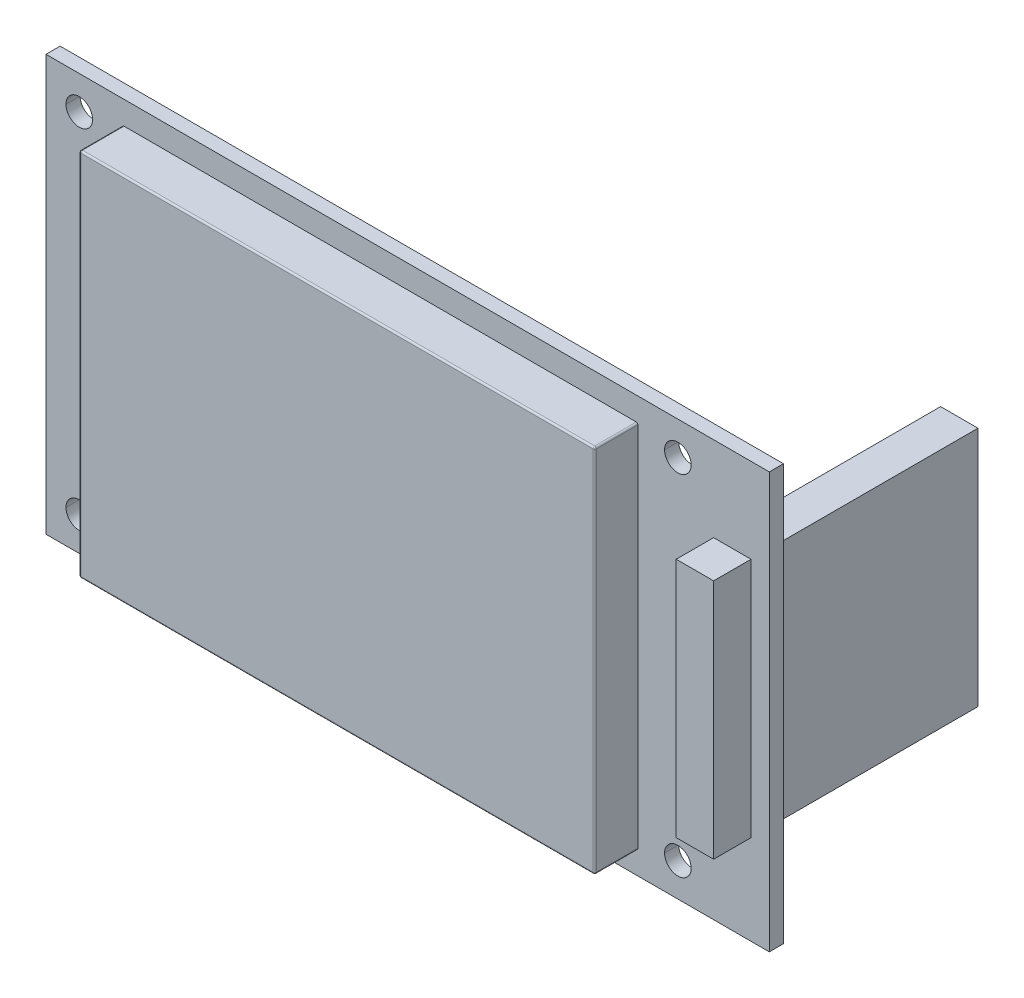
ISO-10303-21;
HEADER;
FILE_DESCRIPTION(('STEP AP214'),'2;1');
FILE_NAME('part.step','',(''),(''),'','','');
FILE_SCHEMA(('AUTOMOTIVE_DESIGN { 1 0 10303 214 1 1 1 1 }'));
ENDSEC;
DATA;
#1=APPLICATION_CONTEXT('core data for automotive mechanical design processes');
#2=APPLICATION_PROTOCOL_DEFINITION('international standard','automotive_design',2000,#1);
#3=PRODUCT_CONTEXT('',#1,'mechanical');
#4=PRODUCT('Part','Part','',(#3));
#5=PRODUCT_RELATED_PRODUCT_CATEGORY('part','',(#4));
#6=PRODUCT_DEFINITION_FORMATION('','',#4);
#7=PRODUCT_DEFINITION_CONTEXT('part definition',#1,'design');
#8=PRODUCT_DEFINITION('design','',#6,#7);
#9=PRODUCT_DEFINITION_SHAPE('','',#8);
#10=(LENGTH_UNIT() NAMED_UNIT(*) SI_UNIT(.MILLI.,.METRE.));
#11=(NAMED_UNIT(*) PLANE_ANGLE_UNIT() SI_UNIT($,.RADIAN.));
#12=(NAMED_UNIT(*) SI_UNIT($,.STERADIAN.) SOLID_ANGLE_UNIT());
#13=UNCERTAINTY_MEASURE_WITH_UNIT(LENGTH_MEASURE(1.E-05),#10,'distance_accuracy_value','');
#14=(GEOMETRIC_REPRESENTATION_CONTEXT(3) GLOBAL_UNCERTAINTY_ASSIGNED_CONTEXT((#13)) GLOBAL_UNIT_ASSIGNED_CONTEXT((#10,
#11,#12)) REPRESENTATION_CONTEXT('',''));
#15=CARTESIAN_POINT('',(0.,0.,0.));
#16=DIRECTION('',(0.,0.,1.));
#17=DIRECTION('',(1.,0.,0.));
#18=AXIS2_PLACEMENT_3D('',#15,#16,#17);
#19=CARTESIAN_POINT('',(-39.5,21.,0.));
#20=DIRECTION('',(0.,0.,-1.));
#21=DIRECTION('',(1.,0.,0.));
#22=AXIS2_PLACEMENT_3D('',#19,#20,#21);
#23=CYLINDRICAL_SURFACE('',#22,1.6);
#24=CARTESIAN_POINT('',(-39.5,21.,1.7));
#25=DIRECTION('',(0.,0.,1.));
#26=DIRECTION('',(1.,0.,0.));
#27=AXIS2_PLACEMENT_3D('',#24,#25,#26);
#28=CIRCLE('',#27,1.6);
#29=CARTESIAN_POINT('',(-41.1,21.,1.7));
#30=VERTEX_POINT('',#29);
#31=CARTESIAN_POINT('',(-37.9,21.,1.7));
#32=VERTEX_POINT('',#31);
#33=EDGE_CURVE('E9',#30,#32,#28,.T.);
#34=ORIENTED_EDGE('',*,*,#33,.T.);
#35=DIRECTION('',(0.,0.,-1.));
#36=VECTOR('',#35,1.);
#37=CARTESIAN_POINT('',(-37.9,21.,0.));
#38=LINE('',#37,#36);
#39=CARTESIAN_POINT('',(-37.9,21.,0.));
#40=VERTEX_POINT('',#39);
#41=EDGE_CURVE('E27',#40,#32,#38,.F.);
#42=ORIENTED_EDGE('',*,*,#41,.F.);
#43=CARTESIAN_POINT('',(-39.5,21.,0.));
#44=DIRECTION('',(0.,0.,-1.));
#45=DIRECTION('',(-1.,0.,0.));
#46=AXIS2_PLACEMENT_3D('',#43,#44,#45);
#47=CIRCLE('',#46,1.6);
#48=CARTESIAN_POINT('',(-41.1,21.,0.));
#49=VERTEX_POINT('',#48);
#50=EDGE_CURVE('E1039',#40,#49,#47,.T.);
#51=ORIENTED_EDGE('',*,*,#50,.T.);
#52=DIRECTION('',(0.,0.,-1.));
#53=VECTOR('',#52,1.);
#54=CARTESIAN_POINT('',(-41.1,21.,0.));
#55=LINE('',#54,#53);
#56=EDGE_CURVE('E503',#49,#30,#55,.F.);
#57=ORIENTED_EDGE('',*,*,#56,.T.);
#58=EDGE_LOOP('',(#34,#42,#51,#57));
#59=FACE_BOUND('',#58,.T.);
#60=ADVANCED_FACE('F16',(#59),#23,.F.);
#61=CARTESIAN_POINT('',(32.5,21.,0.));
#62=DIRECTION('',(0.,0.,-1.));
#63=DIRECTION('',(1.,0.,0.));
#64=AXIS2_PLACEMENT_3D('',#61,#62,#63);
#65=CYLINDRICAL_SURFACE('',#64,1.6);
#66=CARTESIAN_POINT('',(32.5,21.,1.7));
#67=DIRECTION('',(0.,0.,1.));
#68=DIRECTION('',(1.,0.,0.));
#69=AXIS2_PLACEMENT_3D('',#66,#67,#68);
#70=CIRCLE('',#69,1.6);
#71=CARTESIAN_POINT('',(30.9,21.,1.7));
#72=VERTEX_POINT('',#71);
#73=CARTESIAN_POINT('',(34.1,21.,1.7));
#74=VERTEX_POINT('',#73);
#75=EDGE_CURVE('E1046',#72,#74,#70,.T.);
#76=ORIENTED_EDGE('',*,*,#75,.T.);
#77=DIRECTION('',(0.,0.,-1.));
#78=VECTOR('',#77,1.);
#79=CARTESIAN_POINT('',(34.1,21.,0.));
#80=LINE('',#79,#78);
#81=CARTESIAN_POINT('',(34.1,21.,0.));
#82=VERTEX_POINT('',#81);
#83=EDGE_CURVE('E1053',#82,#74,#80,.F.);
#84=ORIENTED_EDGE('',*,*,#83,.F.);
#85=CARTESIAN_POINT('',(32.5,21.,0.));
#86=DIRECTION('',(0.,0.,-1.));
#87=DIRECTION('',(-1.,0.,0.));
#88=AXIS2_PLACEMENT_3D('',#85,#86,#87);
#89=CIRCLE('',#88,1.6);
#90=CARTESIAN_POINT('',(30.9,21.,0.));
#91=VERTEX_POINT('',#90);
#92=EDGE_CURVE('E1059',#82,#91,#89,.T.);
#93=ORIENTED_EDGE('',*,*,#92,.T.);
#94=DIRECTION('',(0.,0.,-1.));
#95=VECTOR('',#94,1.);
#96=CARTESIAN_POINT('',(30.9,21.,0.));
#97=LINE('',#96,#95);
#98=EDGE_CURVE('E481',#91,#72,#97,.F.);
#99=ORIENTED_EDGE('',*,*,#98,.T.);
#100=EDGE_LOOP('',(#76,#84,#93,#99));
#101=FACE_BOUND('',#100,.T.);
#102=ADVANCED_FACE('F559',(#101),#65,.F.);
#103=CARTESIAN_POINT('',(32.5,-21.,0.));
#104=DIRECTION('',(0.,0.,-1.));
#105=DIRECTION('',(1.,0.,0.));
#106=AXIS2_PLACEMENT_3D('',#103,#104,#105);
#107=CYLINDRICAL_SURFACE('',#106,1.6);
#108=CARTESIAN_POINT('',(32.5,-21.,1.7));
#109=DIRECTION('',(0.,0.,1.));
#110=DIRECTION('',(1.,0.,0.));
#111=AXIS2_PLACEMENT_3D('',#108,#109,#110);
#112=CIRCLE('',#111,1.6);
#113=CARTESIAN_POINT('',(30.9,-21.,1.7));
#114=VERTEX_POINT('',#113);
#115=CARTESIAN_POINT('',(34.1,-21.,1.7));
#116=VERTEX_POINT('',#115);
#117=EDGE_CURVE('E1066',#114,#116,#112,.T.);
#118=ORIENTED_EDGE('',*,*,#117,.T.);
#119=DIRECTION('',(0.,0.,-1.));
#120=VECTOR('',#119,1.);
#121=CARTESIAN_POINT('',(34.1,-21.,0.));
#122=LINE('',#121,#120);
#123=CARTESIAN_POINT('',(34.1,-21.,0.));
#124=VERTEX_POINT('',#123);
#125=EDGE_CURVE('E1073',#124,#116,#122,.F.);
#126=ORIENTED_EDGE('',*,*,#125,.F.);
#127=CARTESIAN_POINT('',(32.5,-21.,0.));
#128=DIRECTION('',(0.,0.,-1.));
#129=DIRECTION('',(-1.,0.,0.));
#130=AXIS2_PLACEMENT_3D('',#127,#128,#129);
#131=CIRCLE('',#130,1.6);
#132=CARTESIAN_POINT('',(30.9,-21.,0.));
#133=VERTEX_POINT('',#132);
#134=EDGE_CURVE('E1079',#124,#133,#131,.T.);
#135=ORIENTED_EDGE('',*,*,#134,.T.);
#136=DIRECTION('',(0.,0.,-1.));
#137=VECTOR('',#136,1.);
#138=CARTESIAN_POINT('',(30.9,-21.,0.));
#139=LINE('',#138,#137);
#140=EDGE_CURVE('E458',#133,#114,#139,.F.);
#141=ORIENTED_EDGE('',*,*,#140,.T.);
#142=EDGE_LOOP('',(#118,#126,#135,#141));
#143=FACE_BOUND('',#142,.T.);
#144=ADVANCED_FACE('F572',(#143),#107,.F.);
#145=CARTESIAN_POINT('',(-39.5,-21.,0.));
#146=DIRECTION('',(0.,0.,-1.));
#147=DIRECTION('',(1.,0.,0.));
#148=AXIS2_PLACEMENT_3D('',#145,#146,#147);
#149=CYLINDRICAL_SURFACE('',#148,1.6);
#150=CARTESIAN_POINT('',(-39.5,-21.,1.7));
#151=DIRECTION('',(0.,0.,1.));
#152=DIRECTION('',(1.,0.,0.));
#153=AXIS2_PLACEMENT_3D('',#150,#151,#152);
#154=CIRCLE('',#153,1.6);
#155=CARTESIAN_POINT('',(-41.1,-21.,1.7));
#156=VERTEX_POINT('',#155);
#157=CARTESIAN_POINT('',(-37.9,-21.,1.7));
#158=VERTEX_POINT('',#157);
#159=EDGE_CURVE('E1086',#156,#158,#154,.T.);
#160=ORIENTED_EDGE('',*,*,#159,.T.);
#161=DIRECTION('',(0.,0.,-1.));
#162=VECTOR('',#161,1.);
#163=CARTESIAN_POINT('',(-37.9,-21.,0.));
#164=LINE('',#163,#162);
#165=CARTESIAN_POINT('',(-37.9,-21.,0.));
#166=VERTEX_POINT('',#165);
#167=EDGE_CURVE('E1093',#166,#158,#164,.F.);
#168=ORIENTED_EDGE('',*,*,#167,.F.);
#169=CARTESIAN_POINT('',(-39.5,-21.,0.));
#170=DIRECTION('',(0.,0.,-1.));
#171=DIRECTION('',(-1.,0.,0.));
#172=AXIS2_PLACEMENT_3D('',#169,#170,#171);
#173=CIRCLE('',#172,1.6);
#174=CARTESIAN_POINT('',(-41.1,-21.,0.));
#175=VERTEX_POINT('',#174);
#176=EDGE_CURVE('E1099',#166,#175,#173,.T.);
#177=ORIENTED_EDGE('',*,*,#176,.T.);
#178=DIRECTION('',(0.,0.,-1.));
#179=VECTOR('',#178,1.);
#180=CARTESIAN_POINT('',(-41.1,-21.,0.));
#181=LINE('',#180,#179);
#182=EDGE_CURVE('E245',#175,#156,#181,.F.);
#183=ORIENTED_EDGE('',*,*,#182,.T.);
#184=EDGE_LOOP('',(#160,#168,#177,#183));
#185=FACE_BOUND('',#184,.T.);
#186=ADVANCED_FACE('F584',(#185),#149,.F.);
#187=CARTESIAN_POINT('',(0.,0.,1.7));
#188=DIRECTION('',(0.,0.,1.));
#189=DIRECTION('',(-1.,0.,0.));
#190=AXIS2_PLACEMENT_3D('',#187,#188,#189);
#191=PLANE('',#190);
#192=ORIENTED_EDGE('',*,*,#33,.F.);
#193=CARTESIAN_POINT('',(-39.5,21.,1.7));
#194=DIRECTION('',(0.,0.,1.));
#195=DIRECTION('',(1.,0.,0.));
#196=AXIS2_PLACEMENT_3D('',#193,#194,#195);
#197=CIRCLE('',#196,1.6);
#198=EDGE_CURVE('E497',#32,#30,#197,.T.);
#199=ORIENTED_EDGE('',*,*,#198,.F.);
#200=EDGE_LOOP('',(#192,#199));
#201=FACE_BOUND('',#200,.T.);
#202=ORIENTED_EDGE('',*,*,#75,.F.);
#203=CARTESIAN_POINT('',(32.5,21.,1.7));
#204=DIRECTION('',(0.,0.,1.));
#205=DIRECTION('',(1.,0.,0.));
#206=AXIS2_PLACEMENT_3D('',#203,#204,#205);
#207=CIRCLE('',#206,1.6);
#208=EDGE_CURVE('E474',#74,#72,#207,.T.);
#209=ORIENTED_EDGE('',*,*,#208,.F.);
#210=EDGE_LOOP('',(#202,#209));
#211=FACE_BOUND('',#210,.T.);
#212=ORIENTED_EDGE('',*,*,#117,.F.);
#213=CARTESIAN_POINT('',(32.5,-21.,1.7));
#214=DIRECTION('',(0.,0.,1.));
#215=DIRECTION('',(1.,0.,0.));
#216=AXIS2_PLACEMENT_3D('',#213,#214,#215);
#217=CIRCLE('',#216,1.6);
#218=EDGE_CURVE('E451',#116,#114,#217,.T.);
#219=ORIENTED_EDGE('',*,*,#218,.F.);
#220=EDGE_LOOP('',(#212,#219));
#221=FACE_BOUND('',#220,.T.);
#222=ORIENTED_EDGE('',*,*,#159,.F.);
#223=CARTESIAN_POINT('',(-39.5,-21.,1.7));
#224=DIRECTION('',(0.,0.,1.));
#225=DIRECTION('',(1.,0.,0.));
#226=AXIS2_PLACEMENT_3D('',#223,#224,#225);
#227=CIRCLE('',#226,1.6);
#228=EDGE_CURVE('E238',#158,#156,#227,.T.);
#229=ORIENTED_EDGE('',*,*,#228,.F.);
#230=EDGE_LOOP('',(#222,#229));
#231=FACE_BOUND('',#230,.T.);
#232=DIRECTION('',(-1.,0.,0.));
#233=VECTOR('',#232,1.);
#234=CARTESIAN_POINT('',(-34.3,22.2,1.7));
#235=LINE('',#234,#233);
#236=CARTESIAN_POINT('',(27.5,22.2,1.7));
#237=VERTEX_POINT('',#236);
#238=CARTESIAN_POINT('',(-34.1,22.2,1.7));
#239=VERTEX_POINT('',#238);
#240=EDGE_CURVE('E1212',#237,#239,#235,.T.);
#241=ORIENTED_EDGE('',*,*,#240,.F.);
#242=CARTESIAN_POINT('',(27.5,22.,1.7));
#243=DIRECTION('',(0.,0.,-1.));
#244=DIRECTION('',(1.,0.,0.));
#245=AXIS2_PLACEMENT_3D('',#242,#243,#244);
#246=CIRCLE('',#245,0.2);
#247=CARTESIAN_POINT('',(27.7,22.,1.7));
#248=VERTEX_POINT('',#247);
#249=EDGE_CURVE('E1106',#237,#248,#246,.T.);
#250=ORIENTED_EDGE('',*,*,#249,.T.);
#251=DIRECTION('',(0.,1.,0.));
#252=VECTOR('',#251,1.);
#253=CARTESIAN_POINT('',(27.7,22.2,1.7));
#254=LINE('',#253,#252);
#255=CARTESIAN_POINT('',(27.7,-22.1,1.7));
#256=VERTEX_POINT('',#255);
#257=EDGE_CURVE('E345',#256,#248,#254,.T.);
#258=ORIENTED_EDGE('',*,*,#257,.F.);
#259=CARTESIAN_POINT('',(27.5,-22.1,1.7));
#260=DIRECTION('',(0.,0.,-1.));
#261=DIRECTION('',(1.,0.,0.));
#262=AXIS2_PLACEMENT_3D('',#259,#260,#261);
#263=CIRCLE('',#262,0.2);
#264=CARTESIAN_POINT('',(27.5,-22.3,1.7));
#265=VERTEX_POINT('',#264);
#266=EDGE_CURVE('E1113',#256,#265,#263,.T.);
#267=ORIENTED_EDGE('',*,*,#266,.T.);
#268=DIRECTION('',(1.,0.,0.));
#269=VECTOR('',#268,1.);
#270=CARTESIAN_POINT('',(27.7,-22.3,1.7));
#271=LINE('',#270,#269);
#272=CARTESIAN_POINT('',(-34.1,-22.3,1.7));
#273=VERTEX_POINT('',#272);
#274=EDGE_CURVE('E340',#273,#265,#271,.T.);
#275=ORIENTED_EDGE('',*,*,#274,.F.);
#276=CARTESIAN_POINT('',(-34.1,-22.1,1.7));
#277=DIRECTION('',(0.,0.,-1.));
#278=DIRECTION('',(1.,0.,0.));
#279=AXIS2_PLACEMENT_3D('',#276,#277,#278);
#280=CIRCLE('',#279,0.2);
#281=CARTESIAN_POINT('',(-34.3,-22.1,1.7));
#282=VERTEX_POINT('',#281);
#283=EDGE_CURVE('E1120',#273,#282,#280,.T.);
#284=ORIENTED_EDGE('',*,*,#283,.T.);
#285=DIRECTION('',(0.,-1.,0.));
#286=VECTOR('',#285,1.);
#287=CARTESIAN_POINT('',(-34.3,-22.3,1.7));
#288=LINE('',#287,#286);
#289=CARTESIAN_POINT('',(-34.3,22.,1.7));
#290=VERTEX_POINT('',#289);
#291=EDGE_CURVE('E313',#290,#282,#288,.T.);
#292=ORIENTED_EDGE('',*,*,#291,.F.);
#293=CARTESIAN_POINT('',(-34.1,22.,1.7));
#294=DIRECTION('',(0.,0.,-1.));
#295=DIRECTION('',(1.,0.,0.));
#296=AXIS2_PLACEMENT_3D('',#293,#294,#295);
#297=CIRCLE('',#296,0.2);
#298=EDGE_CURVE('E310',#290,#239,#297,.T.);
#299=ORIENTED_EDGE('',*,*,#298,.T.);
#300=EDGE_LOOP('',(#241,#250,#258,#267,#275,#284,#292,#299));
#301=FACE_BOUND('',#300,.T.);
#302=DIRECTION('',(-1.,0.,0.));
#303=VECTOR('',#302,1.);
#304=CARTESIAN_POINT('',(43.5,25.,1.7));
#305=LINE('',#304,#303);
#306=CARTESIAN_POINT('',(43.5,25.,1.7));
#307=VERTEX_POINT('',#306);
#308=CARTESIAN_POINT('',(-43.5,25.,1.7));
#309=VERTEX_POINT('',#308);
#310=EDGE_CURVE('E1132',#307,#309,#305,.T.);
#311=ORIENTED_EDGE('',*,*,#310,.T.);
#312=DIRECTION('',(0.,-1.,0.));
#313=VECTOR('',#312,1.);
#314=CARTESIAN_POINT('',(-43.5,25.,1.7));
#315=LINE('',#314,#313);
#316=CARTESIAN_POINT('',(-43.5,-25.,1.7));
#317=VERTEX_POINT('',#316);
#318=EDGE_CURVE('E1139',#309,#317,#315,.T.);
#319=ORIENTED_EDGE('',*,*,#318,.T.);
#320=DIRECTION('',(1.,0.,0.));
#321=VECTOR('',#320,1.);
#322=CARTESIAN_POINT('',(-43.5,-25.,1.7));
#323=LINE('',#322,#321);
#324=CARTESIAN_POINT('',(43.5,-25.,1.7));
#325=VERTEX_POINT('',#324);
#326=EDGE_CURVE('E1146',#317,#325,#323,.T.);
#327=ORIENTED_EDGE('',*,*,#326,.T.);
#328=DIRECTION('',(0.,1.,0.));
#329=VECTOR('',#328,1.);
#330=CARTESIAN_POINT('',(43.5,-25.,1.7));
#331=LINE('',#330,#329);
#332=EDGE_CURVE('E1153',#325,#307,#331,.T.);
#333=ORIENTED_EDGE('',*,*,#332,.T.);
#334=EDGE_LOOP('',(#311,#319,#327,#333));
#335=FACE_BOUND('',#334,.T.);
#336=DIRECTION('',(1.,0.,0.));
#337=VECTOR('',#336,1.);
#338=CARTESIAN_POINT('',(41.3,-14.2,1.7));
#339=LINE('',#338,#337);
#340=CARTESIAN_POINT('',(36.8,-14.2,1.7));
#341=VERTEX_POINT('',#340);
#342=CARTESIAN_POINT('',(41.3,-14.2,1.7));
#343=VERTEX_POINT('',#342);
#344=EDGE_CURVE('E409',#341,#343,#339,.T.);
#345=ORIENTED_EDGE('',*,*,#344,.F.);
#346=DIRECTION('',(0.,-1.,0.));
#347=VECTOR('',#346,1.);
#348=CARTESIAN_POINT('',(36.8,-14.2,1.7));
#349=LINE('',#348,#347);
#350=CARTESIAN_POINT('',(36.8,14.8,1.7));
#351=VERTEX_POINT('',#350);
#352=EDGE_CURVE('E404',#351,#341,#349,.T.);
#353=ORIENTED_EDGE('',*,*,#352,.F.);
#354=DIRECTION('',(-1.,0.,0.));
#355=VECTOR('',#354,1.);
#356=CARTESIAN_POINT('',(36.8,14.8,1.7));
#357=LINE('',#356,#355);
#358=CARTESIAN_POINT('',(41.3,14.8,1.7));
#359=VERTEX_POINT('',#358);
#360=EDGE_CURVE('E230',#359,#351,#357,.T.);
#361=ORIENTED_EDGE('',*,*,#360,.F.);
#362=DIRECTION('',(0.,1.,0.));
#363=VECTOR('',#362,1.);
#364=CARTESIAN_POINT('',(41.3,14.8,1.7));
#365=LINE('',#364,#363);
#366=EDGE_CURVE('E227',#343,#359,#365,.T.);
#367=ORIENTED_EDGE('',*,*,#366,.F.);
#368=EDGE_LOOP('',(#345,#353,#361,#367));
#369=FACE_BOUND('',#368,.T.);
#370=ADVANCED_FACE('F596',(#201,#211,#221,#231,#301,#335,#369),#191,.T.);
#371=CARTESIAN_POINT('',(0.,0.,0.));
#372=DIRECTION('',(0.,0.,1.));
#373=DIRECTION('',(-1.,0.,0.));
#374=AXIS2_PLACEMENT_3D('',#371,#372,#373);
#375=PLANE('',#374);
#376=CARTESIAN_POINT('',(-39.5,21.,0.));
#377=DIRECTION('',(0.,0.,-1.));
#378=DIRECTION('',(-1.,0.,0.));
#379=AXIS2_PLACEMENT_3D('',#376,#377,#378);
#380=CIRCLE('',#379,1.6);
#381=EDGE_CURVE('E251',#49,#40,#380,.T.);
#382=ORIENTED_EDGE('',*,*,#381,.F.);
#383=ORIENTED_EDGE('',*,*,#50,.F.);
#384=EDGE_LOOP('',(#382,#383));
#385=FACE_BOUND('',#384,.T.);
#386=CARTESIAN_POINT('',(32.5,21.,0.));
#387=DIRECTION('',(0.,0.,-1.));
#388=DIRECTION('',(-1.,0.,0.));
#389=AXIS2_PLACEMENT_3D('',#386,#387,#388);
#390=CIRCLE('',#389,1.6);
#391=EDGE_CURVE('E488',#91,#82,#390,.T.);
#392=ORIENTED_EDGE('',*,*,#391,.F.);
#393=ORIENTED_EDGE('',*,*,#92,.F.);
#394=EDGE_LOOP('',(#392,#393));
#395=FACE_BOUND('',#394,.T.);
#396=CARTESIAN_POINT('',(32.5,-21.,0.));
#397=DIRECTION('',(0.,0.,-1.));
#398=DIRECTION('',(-1.,0.,0.));
#399=AXIS2_PLACEMENT_3D('',#396,#397,#398);
#400=CIRCLE('',#399,1.6);
#401=EDGE_CURVE('E465',#133,#124,#400,.T.);
#402=ORIENTED_EDGE('',*,*,#401,.F.);
#403=ORIENTED_EDGE('',*,*,#134,.F.);
#404=EDGE_LOOP('',(#402,#403));
#405=FACE_BOUND('',#404,.T.);
#406=CARTESIAN_POINT('',(-39.5,-21.,0.));
#407=DIRECTION('',(0.,0.,-1.));
#408=DIRECTION('',(-1.,0.,0.));
#409=AXIS2_PLACEMENT_3D('',#406,#407,#408);
#410=CIRCLE('',#409,1.6);
#411=EDGE_CURVE('E440',#175,#166,#410,.T.);
#412=ORIENTED_EDGE('',*,*,#411,.F.);
#413=ORIENTED_EDGE('',*,*,#176,.F.);
#414=EDGE_LOOP('',(#412,#413));
#415=FACE_BOUND('',#414,.T.);
#416=DIRECTION('',(-1.,0.,0.));
#417=VECTOR('',#416,1.);
#418=CARTESIAN_POINT('',(43.5,25.,0.));
#419=LINE('',#418,#417);
#420=CARTESIAN_POINT('',(43.5,25.,0.));
#421=VERTEX_POINT('',#420);
#422=CARTESIAN_POINT('',(-43.5,25.,0.));
#423=VERTEX_POINT('',#422);
#424=EDGE_CURVE('E1159',#421,#423,#419,.T.);
#425=ORIENTED_EDGE('',*,*,#424,.F.);
#426=DIRECTION('',(0.,1.,0.));
#427=VECTOR('',#426,1.);
#428=CARTESIAN_POINT('',(43.5,-25.,0.));
#429=LINE('',#428,#427);
#430=CARTESIAN_POINT('',(43.5,-25.,0.));
#431=VERTEX_POINT('',#430);
#432=EDGE_CURVE('E1173',#431,#421,#429,.T.);
#433=ORIENTED_EDGE('',*,*,#432,.F.);
#434=DIRECTION('',(1.,0.,0.));
#435=VECTOR('',#434,1.);
#436=CARTESIAN_POINT('',(-43.5,-25.,0.));
#437=LINE('',#436,#435);
#438=CARTESIAN_POINT('',(-43.5,-25.,0.));
#439=VERTEX_POINT('',#438);
#440=EDGE_CURVE('E1186',#439,#431,#437,.T.);
#441=ORIENTED_EDGE('',*,*,#440,.F.);
#442=DIRECTION('',(0.,-1.,0.));
#443=VECTOR('',#442,1.);
#444=CARTESIAN_POINT('',(-43.5,25.,0.));
#445=LINE('',#444,#443);
#446=EDGE_CURVE('E1199',#423,#439,#445,.T.);
#447=ORIENTED_EDGE('',*,*,#446,.F.);
#448=EDGE_LOOP('',(#425,#433,#441,#447));
#449=FACE_BOUND('',#448,.T.);
#450=DIRECTION('',(0.,1.,0.));
#451=VECTOR('',#450,1.);
#452=CARTESIAN_POINT('',(36.8,14.8,0.));
#453=LINE('',#452,#451);
#454=CARTESIAN_POINT('',(36.8,-14.2,0.));
#455=VERTEX_POINT('',#454);
#456=CARTESIAN_POINT('',(36.8,14.8,0.));
#457=VERTEX_POINT('',#456);
#458=EDGE_CURVE('E371',#455,#457,#453,.T.);
#459=ORIENTED_EDGE('',*,*,#458,.F.);
#460=DIRECTION('',(-1.,0.,0.));
#461=VECTOR('',#460,1.);
#462=CARTESIAN_POINT('',(36.8,-14.2,0.));
#463=LINE('',#462,#461);
#464=CARTESIAN_POINT('',(41.3,-14.2,0.));
#465=VERTEX_POINT('',#464);
#466=EDGE_CURVE('E391',#465,#455,#463,.T.);
#467=ORIENTED_EDGE('',*,*,#466,.F.);
#468=DIRECTION('',(0.,-1.,0.));
#469=VECTOR('',#468,1.);
#470=CARTESIAN_POINT('',(41.3,-14.2,0.));
#471=LINE('',#470,#469);
#472=CARTESIAN_POINT('',(41.3,14.8,0.));
#473=VERTEX_POINT('',#472);
#474=EDGE_CURVE('E377',#473,#465,#471,.T.);
#475=ORIENTED_EDGE('',*,*,#474,.F.);
#476=DIRECTION('',(1.,0.,0.));
#477=VECTOR('',#476,1.);
#478=CARTESIAN_POINT('',(41.3,14.8,0.));
#479=LINE('',#478,#477);
#480=EDGE_CURVE('E376',#457,#473,#479,.T.);
#481=ORIENTED_EDGE('',*,*,#480,.F.);
#482=EDGE_LOOP('',(#459,#467,#475,#481));
#483=FACE_BOUND('',#482,.T.);
#484=ADVANCED_FACE('F608',(#385,#395,#405,#415,#449,#483),#375,.F.);
#485=CARTESIAN_POINT('',(43.5,25.,0.));
#486=DIRECTION('',(0.,1.,0.));
#487=DIRECTION('',(0.,0.,-1.));
#488=AXIS2_PLACEMENT_3D('',#485,#486,#487);
#489=PLANE('',#488);
#490=ORIENTED_EDGE('',*,*,#310,.F.);
#491=DIRECTION('',(0.,0.,1.));
#492=VECTOR('',#491,1.);
#493=CARTESIAN_POINT('',(43.5,25.,0.));
#494=LINE('',#493,#492);
#495=EDGE_CURVE('E1179',#421,#307,#494,.T.);
#496=ORIENTED_EDGE('',*,*,#495,.F.);
#497=ORIENTED_EDGE('',*,*,#424,.T.);
#498=DIRECTION('',(0.,0.,1.));
#499=VECTOR('',#498,1.);
#500=CARTESIAN_POINT('',(-43.5,25.,0.));
#501=LINE('',#500,#499);
#502=EDGE_CURVE('E1166',#423,#309,#501,.T.);
#503=ORIENTED_EDGE('',*,*,#502,.T.);
#504=EDGE_LOOP('',(#490,#496,#497,#503));
#505=FACE_BOUND('',#504,.T.);
#506=ADVANCED_FACE('F620',(#505),#489,.T.);
#507=CARTESIAN_POINT('',(43.5,-25.,0.));
#508=DIRECTION('',(1.,0.,0.));
#509=DIRECTION('',(0.,0.,1.));
#510=AXIS2_PLACEMENT_3D('',#507,#508,#509);
#511=PLANE('',#510);
#512=ORIENTED_EDGE('',*,*,#332,.F.);
#513=DIRECTION('',(0.,0.,1.));
#514=VECTOR('',#513,1.);
#515=CARTESIAN_POINT('',(43.5,-25.,0.));
#516=LINE('',#515,#514);
#517=EDGE_CURVE('E1192',#431,#325,#516,.T.);
#518=ORIENTED_EDGE('',*,*,#517,.F.);
#519=ORIENTED_EDGE('',*,*,#432,.T.);
#520=ORIENTED_EDGE('',*,*,#495,.T.);
#521=EDGE_LOOP('',(#512,#518,#519,#520));
#522=FACE_BOUND('',#521,.T.);
#523=ADVANCED_FACE('F632',(#522),#511,.T.);
#524=CARTESIAN_POINT('',(-43.5,-25.,0.));
#525=DIRECTION('',(0.,-1.,0.));
#526=DIRECTION('',(0.,0.,1.));
#527=AXIS2_PLACEMENT_3D('',#524,#525,#526);
#528=PLANE('',#527);
#529=ORIENTED_EDGE('',*,*,#326,.F.);
#530=DIRECTION('',(0.,0.,1.));
#531=VECTOR('',#530,1.);
#532=CARTESIAN_POINT('',(-43.5,-25.,0.));
#533=LINE('',#532,#531);
#534=EDGE_CURVE('E1205',#439,#317,#533,.T.);
#535=ORIENTED_EDGE('',*,*,#534,.F.);
#536=ORIENTED_EDGE('',*,*,#440,.T.);
#537=ORIENTED_EDGE('',*,*,#517,.T.);
#538=EDGE_LOOP('',(#529,#535,#536,#537));
#539=FACE_BOUND('',#538,.T.);
#540=ADVANCED_FACE('F644',(#539),#528,.T.);
#541=CARTESIAN_POINT('',(-43.5,25.,0.));
#542=DIRECTION('',(-1.,0.,0.));
#543=DIRECTION('',(0.,0.,-1.));
#544=AXIS2_PLACEMENT_3D('',#541,#542,#543);
#545=PLANE('',#544);
#546=ORIENTED_EDGE('',*,*,#318,.F.);
#547=ORIENTED_EDGE('',*,*,#502,.F.);
#548=ORIENTED_EDGE('',*,*,#446,.T.);
#549=ORIENTED_EDGE('',*,*,#534,.T.);
#550=EDGE_LOOP('',(#546,#547,#548,#549));
#551=FACE_BOUND('',#550,.T.);
#552=ADVANCED_FACE('F656',(#551),#545,.T.);
#553=CARTESIAN_POINT('',(-34.3,22.2,6.9));
#554=DIRECTION('',(0.,-1.,0.));
#555=DIRECTION('',(0.,0.,1.));
#556=AXIS2_PLACEMENT_3D('',#553,#554,#555);
#557=PLANE('',#556);
#558=ORIENTED_EDGE('',*,*,#240,.T.);
#559=DIRECTION('',(0.,0.,1.));
#560=VECTOR('',#559,1.);
#561=CARTESIAN_POINT('',(-34.1,22.2,6.9));
#562=LINE('',#561,#560);
#563=CARTESIAN_POINT('',(-34.1,22.2,6.7));
#564=VERTEX_POINT('',#563);
#565=EDGE_CURVE('E1218',#239,#564,#562,.T.);
#566=ORIENTED_EDGE('',*,*,#565,.T.);
#567=DIRECTION('',(1.,0.,0.));
#568=VECTOR('',#567,1.);
#569=CARTESIAN_POINT('',(-34.3,22.2,6.7));
#570=LINE('',#569,#568);
#571=CARTESIAN_POINT('',(27.5,22.2,6.7));
#572=VERTEX_POINT('',#571);
#573=EDGE_CURVE('E326',#564,#572,#570,.T.);
#574=ORIENTED_EDGE('',*,*,#573,.T.);
#575=DIRECTION('',(0.,0.,-1.));
#576=VECTOR('',#575,1.);
#577=CARTESIAN_POINT('',(27.5,22.2,6.9));
#578=LINE('',#577,#576);
#579=EDGE_CURVE('E320',#572,#237,#578,.T.);
#580=ORIENTED_EDGE('',*,*,#579,.T.);
#581=EDGE_LOOP('',(#558,#566,#574,#580));
#582=FACE_BOUND('',#581,.T.);
#583=ADVANCED_FACE('F668',(#582),#557,.F.);
#584=CARTESIAN_POINT('',(-34.3,-22.3,6.9));
#585=DIRECTION('',(1.,0.,0.));
#586=DIRECTION('',(0.,-1.,0.));
#587=AXIS2_PLACEMENT_3D('',#584,#585,#586);
#588=PLANE('',#587);
#589=DIRECTION('',(0.,1.,0.));
#590=VECTOR('',#589,1.);
#591=CARTESIAN_POINT('',(-34.3,-22.3,6.7));
#592=LINE('',#591,#590);
#593=CARTESIAN_POINT('',(-34.3,-22.1,6.7));
#594=VERTEX_POINT('',#593);
#595=CARTESIAN_POINT('',(-34.3,22.,6.7));
#596=VERTEX_POINT('',#595);
#597=EDGE_CURVE('E299',#594,#596,#592,.T.);
#598=ORIENTED_EDGE('',*,*,#597,.T.);
#599=DIRECTION('',(0.,0.,-1.));
#600=VECTOR('',#599,1.);
#601=CARTESIAN_POINT('',(-34.3,22.,6.9));
#602=LINE('',#601,#600);
#603=EDGE_CURVE('E307',#596,#290,#602,.T.);
#604=ORIENTED_EDGE('',*,*,#603,.T.);
#605=ORIENTED_EDGE('',*,*,#291,.T.);
#606=DIRECTION('',(0.,0.,1.));
#607=VECTOR('',#606,1.);
#608=CARTESIAN_POINT('',(-34.3,-22.1,6.9));
#609=LINE('',#608,#607);
#610=EDGE_CURVE('E318',#282,#594,#609,.T.);
#611=ORIENTED_EDGE('',*,*,#610,.T.);
#612=EDGE_LOOP('',(#598,#604,#605,#611));
#613=FACE_BOUND('',#612,.T.);
#614=ADVANCED_FACE('F316',(#613),#588,.F.);
#615=CARTESIAN_POINT('',(27.7,-22.3,6.9));
#616=DIRECTION('',(0.,1.,0.));
#617=DIRECTION('',(1.,0.,0.));
#618=AXIS2_PLACEMENT_3D('',#615,#616,#617);
#619=PLANE('',#618);
#620=DIRECTION('',(-1.,0.,0.));
#621=VECTOR('',#620,1.);
#622=CARTESIAN_POINT('',(27.7,-22.3,6.7));
#623=LINE('',#622,#621);
#624=CARTESIAN_POINT('',(27.5,-22.3,6.7));
#625=VERTEX_POINT('',#624);
#626=CARTESIAN_POINT('',(-34.1,-22.3,6.7));
#627=VERTEX_POINT('',#626);
#628=EDGE_CURVE('E332',#625,#627,#623,.T.);
#629=ORIENTED_EDGE('',*,*,#628,.T.);
#630=DIRECTION('',(0.,0.,-1.));
#631=VECTOR('',#630,1.);
#632=CARTESIAN_POINT('',(-34.1,-22.3,6.9));
#633=LINE('',#632,#631);
#634=EDGE_CURVE('E336',#627,#273,#633,.T.);
#635=ORIENTED_EDGE('',*,*,#634,.T.);
#636=ORIENTED_EDGE('',*,*,#274,.T.);
#637=DIRECTION('',(0.,0.,1.));
#638=VECTOR('',#637,1.);
#639=CARTESIAN_POINT('',(27.5,-22.3,6.9));
#640=LINE('',#639,#638);
#641=EDGE_CURVE('E341',#265,#625,#640,.T.);
#642=ORIENTED_EDGE('',*,*,#641,.T.);
#643=EDGE_LOOP('',(#629,#635,#636,#642));
#644=FACE_BOUND('',#643,.T.);
#645=ADVANCED_FACE('F691',(#644),#619,.F.);
#646=CARTESIAN_POINT('',(27.7,22.2,6.9));
#647=DIRECTION('',(-1.,0.,0.));
#648=DIRECTION('',(0.,1.,0.));
#649=AXIS2_PLACEMENT_3D('',#646,#647,#648);
#650=PLANE('',#649);
#651=ORIENTED_EDGE('',*,*,#257,.T.);
#652=DIRECTION('',(0.,0.,1.));
#653=VECTOR('',#652,1.);
#654=CARTESIAN_POINT('',(27.7,22.,6.9));
#655=LINE('',#654,#653);
#656=CARTESIAN_POINT('',(27.7,22.,6.7));
#657=VERTEX_POINT('',#656);
#658=EDGE_CURVE('E346',#248,#657,#655,.T.);
#659=ORIENTED_EDGE('',*,*,#658,.T.);
#660=DIRECTION('',(0.,-1.,0.));
#661=VECTOR('',#660,1.);
#662=CARTESIAN_POINT('',(27.7,22.2,6.7));
#663=LINE('',#662,#661);
#664=CARTESIAN_POINT('',(27.7,-22.1,6.7));
#665=VERTEX_POINT('',#664);
#666=EDGE_CURVE('E350',#657,#665,#663,.T.);
#667=ORIENTED_EDGE('',*,*,#666,.T.);
#668=DIRECTION('',(0.,0.,-1.));
#669=VECTOR('',#668,1.);
#670=CARTESIAN_POINT('',(27.7,-22.1,6.9));
#671=LINE('',#670,#669);
#672=EDGE_CURVE('E354',#665,#256,#671,.T.);
#673=ORIENTED_EDGE('',*,*,#672,.T.);
#674=EDGE_LOOP('',(#651,#659,#667,#673));
#675=FACE_BOUND('',#674,.T.);
#676=ADVANCED_FACE('F702',(#675),#650,.F.);
#677=CARTESIAN_POINT('',(0.,0.,6.9));
#678=DIRECTION('',(0.,0.,-1.));
#679=DIRECTION('',(1.,0.,0.));
#680=AXIS2_PLACEMENT_3D('',#677,#678,#679);
#681=PLANE('',#680);
#682=DIRECTION('',(0.,1.,0.));
#683=VECTOR('',#682,1.);
#684=CARTESIAN_POINT('',(27.5,0.,6.9));
#685=LINE('',#684,#683);
#686=CARTESIAN_POINT('',(27.5,-22.1,6.9));
#687=VERTEX_POINT('',#686);
#688=CARTESIAN_POINT('',(27.5,22.,6.9));
#689=VERTEX_POINT('',#688);
#690=EDGE_CURVE('E358',#687,#689,#685,.T.);
#691=ORIENTED_EDGE('',*,*,#690,.T.);
#692=DIRECTION('',(-1.,0.,0.));
#693=VECTOR('',#692,1.);
#694=CARTESIAN_POINT('',(0.,22.,6.9));
#695=LINE('',#694,#693);
#696=CARTESIAN_POINT('',(-34.1,22.,6.9));
#697=VERTEX_POINT('',#696);
#698=EDGE_CURVE('E362',#689,#697,#695,.T.);
#699=ORIENTED_EDGE('',*,*,#698,.T.);
#700=DIRECTION('',(0.,-1.,0.));
#701=VECTOR('',#700,1.);
#702=CARTESIAN_POINT('',(-34.1,0.,6.9));
#703=LINE('',#702,#701);
#704=CARTESIAN_POINT('',(-34.1,-22.1,6.9));
#705=VERTEX_POINT('',#704);
#706=EDGE_CURVE('E302',#697,#705,#703,.T.);
#707=ORIENTED_EDGE('',*,*,#706,.T.);
#708=DIRECTION('',(1.,0.,0.));
#709=VECTOR('',#708,1.);
#710=CARTESIAN_POINT('',(0.,-22.1,6.9));
#711=LINE('',#710,#709);
#712=EDGE_CURVE('E367',#705,#687,#711,.T.);
#713=ORIENTED_EDGE('',*,*,#712,.T.);
#714=EDGE_LOOP('',(#691,#699,#707,#713));
#715=FACE_BOUND('',#714,.T.);
#716=ADVANCED_FACE('F714',(#715),#681,.F.);
#717=CARTESIAN_POINT('',(36.8,14.8,-25.6));
#718=DIRECTION('',(1.,0.,0.));
#719=DIRECTION('',(0.,0.,1.));
#720=AXIS2_PLACEMENT_3D('',#717,#718,#719);
#721=PLANE('',#720);
#722=ORIENTED_EDGE('',*,*,#458,.T.);
#723=DIRECTION('',(0.,0.,1.));
#724=VECTOR('',#723,1.);
#725=CARTESIAN_POINT('',(36.8,14.8,-25.6));
#726=LINE('',#725,#724);
#727=CARTESIAN_POINT('',(36.8,14.8,-25.6));
#728=VERTEX_POINT('',#727);
#729=EDGE_CURVE('E372',#728,#457,#726,.T.);
#730=ORIENTED_EDGE('',*,*,#729,.F.);
#731=DIRECTION('',(0.,1.,0.));
#732=VECTOR('',#731,1.);
#733=CARTESIAN_POINT('',(36.8,14.8,-25.6));
#734=LINE('',#733,#732);
#735=CARTESIAN_POINT('',(36.8,-14.2,-25.6));
#736=VERTEX_POINT('',#735);
#737=EDGE_CURVE('E378',#736,#728,#734,.T.);
#738=ORIENTED_EDGE('',*,*,#737,.F.);
#739=DIRECTION('',(0.,0.,1.));
#740=VECTOR('',#739,1.);
#741=CARTESIAN_POINT('',(36.8,-14.2,-25.6));
#742=LINE('',#741,#740);
#743=EDGE_CURVE('E383',#736,#455,#742,.T.);
#744=ORIENTED_EDGE('',*,*,#743,.T.);
#745=EDGE_LOOP('',(#722,#730,#738,#744));
#746=FACE_BOUND('',#745,.T.);
#747=ADVANCED_FACE('F726',(#746),#721,.F.);
#748=CARTESIAN_POINT('',(41.3,14.8,-25.6));
#749=DIRECTION('',(0.,-1.,0.));
#750=DIRECTION('',(0.,0.,1.));
#751=AXIS2_PLACEMENT_3D('',#748,#749,#750);
#752=PLANE('',#751);
#753=ORIENTED_EDGE('',*,*,#480,.T.);
#754=DIRECTION('',(0.,0.,1.));
#755=VECTOR('',#754,1.);
#756=CARTESIAN_POINT('',(41.3,14.8,-25.6));
#757=LINE('',#756,#755);
#758=CARTESIAN_POINT('',(41.3,14.8,-25.6));
#759=VERTEX_POINT('',#758);
#760=EDGE_CURVE('E387',#759,#473,#757,.T.);
#761=ORIENTED_EDGE('',*,*,#760,.F.);
#762=DIRECTION('',(1.,0.,0.));
#763=VECTOR('',#762,1.);
#764=CARTESIAN_POINT('',(41.3,14.8,-25.6));
#765=LINE('',#764,#763);
#766=EDGE_CURVE('E382',#728,#759,#765,.T.);
#767=ORIENTED_EDGE('',*,*,#766,.F.);
#768=ORIENTED_EDGE('',*,*,#729,.T.);
#769=EDGE_LOOP('',(#753,#761,#767,#768));
#770=FACE_BOUND('',#769,.T.);
#771=ADVANCED_FACE('F738',(#770),#752,.F.);
#772=CARTESIAN_POINT('',(41.3,-14.2,-25.6));
#773=DIRECTION('',(-1.,0.,0.));
#774=DIRECTION('',(0.,0.,-1.));
#775=AXIS2_PLACEMENT_3D('',#772,#773,#774);
#776=PLANE('',#775);
#777=ORIENTED_EDGE('',*,*,#474,.T.);
#778=DIRECTION('',(0.,0.,1.));
#779=VECTOR('',#778,1.);
#780=CARTESIAN_POINT('',(41.3,-14.2,-25.6));
#781=LINE('',#780,#779);
#782=CARTESIAN_POINT('',(41.3,-14.2,-25.6));
#783=VERTEX_POINT('',#782);
#784=EDGE_CURVE('E381',#783,#465,#781,.T.);
#785=ORIENTED_EDGE('',*,*,#784,.F.);
#786=DIRECTION('',(0.,-1.,0.));
#787=VECTOR('',#786,1.);
#788=CARTESIAN_POINT('',(41.3,-14.2,-25.6));
#789=LINE('',#788,#787);
#790=EDGE_CURVE('E394',#759,#783,#789,.T.);
#791=ORIENTED_EDGE('',*,*,#790,.F.);
#792=ORIENTED_EDGE('',*,*,#760,.T.);
#793=EDGE_LOOP('',(#777,#785,#791,#792));
#794=FACE_BOUND('',#793,.T.);
#795=ADVANCED_FACE('F750',(#794),#776,.F.);
#796=CARTESIAN_POINT('',(36.8,-14.2,-25.6));
#797=DIRECTION('',(0.,1.,0.));
#798=DIRECTION('',(0.,0.,-1.));
#799=AXIS2_PLACEMENT_3D('',#796,#797,#798);
#800=PLANE('',#799);
#801=ORIENTED_EDGE('',*,*,#466,.T.);
#802=ORIENTED_EDGE('',*,*,#743,.F.);
#803=DIRECTION('',(-1.,0.,0.));
#804=VECTOR('',#803,1.);
#805=CARTESIAN_POINT('',(36.8,-14.2,-25.6));
#806=LINE('',#805,#804);
#807=EDGE_CURVE('E400',#783,#736,#806,.T.);
#808=ORIENTED_EDGE('',*,*,#807,.F.);
#809=ORIENTED_EDGE('',*,*,#784,.T.);
#810=EDGE_LOOP('',(#801,#802,#808,#809));
#811=FACE_BOUND('',#810,.T.);
#812=ADVANCED_FACE('F762',(#811),#800,.F.);
#813=CARTESIAN_POINT('',(0.,0.,-25.6));
#814=DIRECTION('',(0.,0.,1.));
#815=DIRECTION('',(-1.,0.,0.));
#816=AXIS2_PLACEMENT_3D('',#813,#814,#815);
#817=PLANE('',#816);
#818=ORIENTED_EDGE('',*,*,#737,.T.);
#819=ORIENTED_EDGE('',*,*,#766,.T.);
#820=ORIENTED_EDGE('',*,*,#790,.T.);
#821=ORIENTED_EDGE('',*,*,#807,.T.);
#822=EDGE_LOOP('',(#818,#819,#820,#821));
#823=FACE_BOUND('',#822,.T.);
#824=ADVANCED_FACE('F774',(#823),#817,.F.);
#825=CARTESIAN_POINT('',(36.8,-14.2,6.2));
#826=DIRECTION('',(1.,0.,0.));
#827=DIRECTION('',(0.,0.,1.));
#828=AXIS2_PLACEMENT_3D('',#825,#826,#827);
#829=PLANE('',#828);
#830=ORIENTED_EDGE('',*,*,#352,.T.);
#831=DIRECTION('',(0.,0.,-1.));
#832=VECTOR('',#831,1.);
#833=CARTESIAN_POINT('',(36.8,-14.2,6.2));
#834=LINE('',#833,#832);
#835=CARTESIAN_POINT('',(36.8,-14.2,6.2));
#836=VERTEX_POINT('',#835);
#837=EDGE_CURVE('E405',#836,#341,#834,.T.);
#838=ORIENTED_EDGE('',*,*,#837,.F.);
#839=DIRECTION('',(0.,-1.,0.));
#840=VECTOR('',#839,1.);
#841=CARTESIAN_POINT('',(36.8,-14.2,6.2));
#842=LINE('',#841,#840);
#843=CARTESIAN_POINT('',(36.8,14.8,6.2));
#844=VERTEX_POINT('',#843);
#845=EDGE_CURVE('E231',#844,#836,#842,.T.);
#846=ORIENTED_EDGE('',*,*,#845,.F.);
#847=DIRECTION('',(0.,0.,-1.));
#848=VECTOR('',#847,1.);
#849=CARTESIAN_POINT('',(36.8,14.8,6.2));
#850=LINE('',#849,#848);
#851=EDGE_CURVE('E236',#844,#351,#850,.T.);
#852=ORIENTED_EDGE('',*,*,#851,.T.);
#853=EDGE_LOOP('',(#830,#838,#846,#852));
#854=FACE_BOUND('',#853,.T.);
#855=ADVANCED_FACE('F786',(#854),#829,.F.);
#856=CARTESIAN_POINT('',(41.3,-14.2,6.2));
#857=DIRECTION('',(0.,1.,0.));
#858=DIRECTION('',(0.,0.,-1.));
#859=AXIS2_PLACEMENT_3D('',#856,#857,#858);
#860=PLANE('',#859);
#861=ORIENTED_EDGE('',*,*,#344,.T.);
#862=DIRECTION('',(0.,0.,-1.));
#863=VECTOR('',#862,1.);
#864=CARTESIAN_POINT('',(41.3,-14.2,6.2));
#865=LINE('',#864,#863);
#866=CARTESIAN_POINT('',(41.3,-14.2,6.2));
#867=VERTEX_POINT('',#866);
#868=EDGE_CURVE('E414',#867,#343,#865,.T.);
#869=ORIENTED_EDGE('',*,*,#868,.F.);
#870=DIRECTION('',(1.,0.,0.));
#871=VECTOR('',#870,1.);
#872=CARTESIAN_POINT('',(41.3,-14.2,6.2));
#873=LINE('',#872,#871);
#874=EDGE_CURVE('E210',#836,#867,#873,.T.);
#875=ORIENTED_EDGE('',*,*,#874,.F.);
#876=ORIENTED_EDGE('',*,*,#837,.T.);
#877=EDGE_LOOP('',(#861,#869,#875,#876));
#878=FACE_BOUND('',#877,.T.);
#879=ADVANCED_FACE('F798',(#878),#860,.F.);
#880=CARTESIAN_POINT('',(41.3,14.8,6.2));
#881=DIRECTION('',(-1.,0.,0.));
#882=DIRECTION('',(0.,0.,-1.));
#883=AXIS2_PLACEMENT_3D('',#880,#881,#882);
#884=PLANE('',#883);
#885=ORIENTED_EDGE('',*,*,#366,.T.);
#886=DIRECTION('',(0.,0.,-1.));
#887=VECTOR('',#886,1.);
#888=CARTESIAN_POINT('',(41.3,14.8,6.2));
#889=LINE('',#888,#887);
#890=CARTESIAN_POINT('',(41.3,14.8,6.2));
#891=VERTEX_POINT('',#890);
#892=EDGE_CURVE('E225',#891,#359,#889,.T.);
#893=ORIENTED_EDGE('',*,*,#892,.F.);
#894=DIRECTION('',(0.,1.,0.));
#895=VECTOR('',#894,1.);
#896=CARTESIAN_POINT('',(41.3,14.8,6.2));
#897=LINE('',#896,#895);
#898=EDGE_CURVE('E214',#867,#891,#897,.T.);
#899=ORIENTED_EDGE('',*,*,#898,.F.);
#900=ORIENTED_EDGE('',*,*,#868,.T.);
#901=EDGE_LOOP('',(#885,#893,#899,#900));
#902=FACE_BOUND('',#901,.T.);
#903=ADVANCED_FACE('F226',(#902),#884,.F.);
#904=CARTESIAN_POINT('',(36.8,14.8,6.2));
#905=DIRECTION('',(0.,-1.,0.));
#906=DIRECTION('',(0.,0.,1.));
#907=AXIS2_PLACEMENT_3D('',#904,#905,#906);
#908=PLANE('',#907);
#909=ORIENTED_EDGE('',*,*,#360,.T.);
#910=ORIENTED_EDGE('',*,*,#851,.F.);
#911=DIRECTION('',(-1.,0.,0.));
#912=VECTOR('',#911,1.);
#913=CARTESIAN_POINT('',(36.8,14.8,6.2));
#914=LINE('',#913,#912);
#915=EDGE_CURVE('E218',#891,#844,#914,.T.);
#916=ORIENTED_EDGE('',*,*,#915,.F.);
#917=ORIENTED_EDGE('',*,*,#892,.T.);
#918=EDGE_LOOP('',(#909,#910,#916,#917));
#919=FACE_BOUND('',#918,.T.);
#920=ADVANCED_FACE('F234',(#919),#908,.F.);
#921=CARTESIAN_POINT('',(0.,0.,6.2));
#922=DIRECTION('',(0.,0.,-1.));
#923=DIRECTION('',(1.,0.,0.));
#924=AXIS2_PLACEMENT_3D('',#921,#922,#923);
#925=PLANE('',#924);
#926=ORIENTED_EDGE('',*,*,#845,.T.);
#927=ORIENTED_EDGE('',*,*,#874,.T.);
#928=ORIENTED_EDGE('',*,*,#898,.T.);
#929=ORIENTED_EDGE('',*,*,#915,.T.);
#930=EDGE_LOOP('',(#926,#927,#928,#929));
#931=FACE_BOUND('',#930,.T.);
#932=ADVANCED_FACE('F216',(#931),#925,.F.);
#933=CARTESIAN_POINT('',(-39.5,-21.,0.));
#934=DIRECTION('',(0.,0.,-1.));
#935=DIRECTION('',(1.,0.,0.));
#936=AXIS2_PLACEMENT_3D('',#933,#934,#935);
#937=CYLINDRICAL_SURFACE('',#936,1.6);
#938=ORIENTED_EDGE('',*,*,#167,.T.);
#939=ORIENTED_EDGE('',*,*,#228,.T.);
#940=ORIENTED_EDGE('',*,*,#182,.F.);
#941=ORIENTED_EDGE('',*,*,#411,.T.);
#942=EDGE_LOOP('',(#938,#939,#940,#941));
#943=FACE_BOUND('',#942,.T.);
#944=ADVANCED_FACE('F841',(#943),#937,.F.);
#945=CARTESIAN_POINT('',(32.5,-21.,0.));
#946=DIRECTION('',(0.,0.,-1.));
#947=DIRECTION('',(1.,0.,0.));
#948=AXIS2_PLACEMENT_3D('',#945,#946,#947);
#949=CYLINDRICAL_SURFACE('',#948,1.6);
#950=ORIENTED_EDGE('',*,*,#125,.T.);
#951=ORIENTED_EDGE('',*,*,#218,.T.);
#952=ORIENTED_EDGE('',*,*,#140,.F.);
#953=ORIENTED_EDGE('',*,*,#401,.T.);
#954=EDGE_LOOP('',(#950,#951,#952,#953));
#955=FACE_BOUND('',#954,.T.);
#956=ADVANCED_FACE('F852',(#955),#949,.F.);
#957=CARTESIAN_POINT('',(32.5,21.,0.));
#958=DIRECTION('',(0.,0.,-1.));
#959=DIRECTION('',(1.,0.,0.));
#960=AXIS2_PLACEMENT_3D('',#957,#958,#959);
#961=CYLINDRICAL_SURFACE('',#960,1.6);
#962=ORIENTED_EDGE('',*,*,#83,.T.);
#963=ORIENTED_EDGE('',*,*,#208,.T.);
#964=ORIENTED_EDGE('',*,*,#98,.F.);
#965=ORIENTED_EDGE('',*,*,#391,.T.);
#966=EDGE_LOOP('',(#962,#963,#964,#965));
#967=FACE_BOUND('',#966,.T.);
#968=ADVANCED_FACE('F864',(#967),#961,.F.);
#969=CARTESIAN_POINT('',(-39.5,21.,0.));
#970=DIRECTION('',(0.,0.,-1.));
#971=DIRECTION('',(1.,0.,0.));
#972=AXIS2_PLACEMENT_3D('',#969,#970,#971);
#973=CYLINDRICAL_SURFACE('',#972,1.6);
#974=ORIENTED_EDGE('',*,*,#41,.T.);
#975=ORIENTED_EDGE('',*,*,#198,.T.);
#976=ORIENTED_EDGE('',*,*,#56,.F.);
#977=ORIENTED_EDGE('',*,*,#381,.T.);
#978=EDGE_LOOP('',(#974,#975,#976,#977));
#979=FACE_BOUND('',#978,.T.);
#980=ADVANCED_FACE('F876',(#979),#973,.F.);
#981=CARTESIAN_POINT('',(27.5,-22.1,6.9));
#982=DIRECTION('',(0.,0.,-1.));
#983=DIRECTION('',(1.,0.,0.));
#984=AXIS2_PLACEMENT_3D('',#981,#982,#983);
#985=CYLINDRICAL_SURFACE('',#984,0.2);
#986=CARTESIAN_POINT('',(27.5,-22.1,6.7));
#987=DIRECTION('',(0.,0.,1.));
#988=DIRECTION('',(1.,0.,0.));
#989=AXIS2_PLACEMENT_3D('',#986,#987,#988);
#990=CIRCLE('',#989,0.2);
#991=EDGE_CURVE('E248',#625,#665,#990,.T.);
#992=ORIENTED_EDGE('',*,*,#991,.F.);
#993=ORIENTED_EDGE('',*,*,#641,.F.);
#994=ORIENTED_EDGE('',*,*,#266,.F.);
#995=ORIENTED_EDGE('',*,*,#672,.F.);
#996=EDGE_LOOP('',(#992,#993,#994,#995));
#997=FACE_BOUND('',#996,.T.);
#998=ADVANCED_FACE('F888',(#997),#985,.T.);
#999=CARTESIAN_POINT('',(27.5,-22.1,6.7));
#1000=DIRECTION('',(0.,0.,1.));
#1001=DIRECTION('',(0.,-1.,0.));
#1002=AXIS2_PLACEMENT_3D('',#999,#1000,#1001);
#1003=SPHERICAL_SURFACE('',#1002,0.2);
#1004=CARTESIAN_POINT('',(27.5,-22.1,6.7));
#1005=DIRECTION('',(-1.,0.,0.));
#1006=DIRECTION('',(0.,0.,-1.));
#1007=AXIS2_PLACEMENT_3D('',#1004,#1005,#1006);
#1008=CIRCLE('',#1007,0.2);
#1009=EDGE_CURVE('E253',#625,#687,#1008,.T.);
#1010=ORIENTED_EDGE('',*,*,#1009,.F.);
#1011=ORIENTED_EDGE('',*,*,#991,.T.);
#1012=CARTESIAN_POINT('',(27.5,-22.1,6.7));
#1013=DIRECTION('',(0.,1.,0.));
#1014=DIRECTION('',(0.,0.,-1.));
#1015=AXIS2_PLACEMENT_3D('',#1012,#1013,#1014);
#1016=CIRCLE('',#1015,0.2);
#1017=EDGE_CURVE('E252',#687,#665,#1016,.T.);
#1018=ORIENTED_EDGE('',*,*,#1017,.F.);
#1019=EDGE_LOOP('',(#1010,#1011,#1018));
#1020=FACE_BOUND('',#1019,.T.);
#1021=ADVANCED_FACE('F899',(#1020),#1003,.T.);
#1022=CARTESIAN_POINT('',(27.5,22.,6.9));
#1023=DIRECTION('',(0.,0.,-1.));
#1024=DIRECTION('',(1.,0.,0.));
#1025=AXIS2_PLACEMENT_3D('',#1022,#1023,#1024);
#1026=CYLINDRICAL_SURFACE('',#1025,0.2);
#1027=ORIENTED_EDGE('',*,*,#249,.F.);
#1028=ORIENTED_EDGE('',*,*,#579,.F.);
#1029=CARTESIAN_POINT('',(27.5,22.,6.7));
#1030=DIRECTION('',(0.,0.,1.));
#1031=DIRECTION('',(1.,0.,0.));
#1032=AXIS2_PLACEMENT_3D('',#1029,#1030,#1031);
#1033=CIRCLE('',#1032,0.2);
#1034=EDGE_CURVE('E260',#657,#572,#1033,.T.);
#1035=ORIENTED_EDGE('',*,*,#1034,.F.);
#1036=ORIENTED_EDGE('',*,*,#658,.F.);
#1037=EDGE_LOOP('',(#1027,#1028,#1035,#1036));
#1038=FACE_BOUND('',#1037,.T.);
#1039=ADVANCED_FACE('F911',(#1038),#1026,.T.);
#1040=CARTESIAN_POINT('',(27.5,0.,6.7));
#1041=DIRECTION('',(0.,1.,0.));
#1042=DIRECTION('',(1.,0.,0.));
#1043=AXIS2_PLACEMENT_3D('',#1040,#1041,#1042);
#1044=CYLINDRICAL_SURFACE('',#1043,0.2);
#1045=ORIENTED_EDGE('',*,*,#1017,.T.);
#1046=ORIENTED_EDGE('',*,*,#666,.F.);
#1047=CARTESIAN_POINT('',(27.5,22.,6.7));
#1048=DIRECTION('',(0.,1.,0.));
#1049=DIRECTION('',(0.,0.,1.));
#1050=AXIS2_PLACEMENT_3D('',#1047,#1048,#1049);
#1051=CIRCLE('',#1050,0.2);
#1052=EDGE_CURVE('E256',#689,#657,#1051,.T.);
#1053=ORIENTED_EDGE('',*,*,#1052,.F.);
#1054=ORIENTED_EDGE('',*,*,#690,.F.);
#1055=EDGE_LOOP('',(#1045,#1046,#1053,#1054));
#1056=FACE_BOUND('',#1055,.T.);
#1057=ADVANCED_FACE('F923',(#1056),#1044,.T.);
#1058=CARTESIAN_POINT('',(0.,-22.1,6.7));
#1059=DIRECTION('',(1.,0.,0.));
#1060=DIRECTION('',(0.,-1.,0.));
#1061=AXIS2_PLACEMENT_3D('',#1058,#1059,#1060);
#1062=CYLINDRICAL_SURFACE('',#1061,0.2);
#1063=ORIENTED_EDGE('',*,*,#1009,.T.);
#1064=ORIENTED_EDGE('',*,*,#712,.F.);
#1065=CARTESIAN_POINT('',(-34.1,-22.1,6.7));
#1066=DIRECTION('',(-1.,0.,0.));
#1067=DIRECTION('',(0.,0.,1.));
#1068=AXIS2_PLACEMENT_3D('',#1065,#1066,#1067);
#1069=CIRCLE('',#1068,0.2);
#1070=EDGE_CURVE('E267',#627,#705,#1069,.T.);
#1071=ORIENTED_EDGE('',*,*,#1070,.F.);
#1072=ORIENTED_EDGE('',*,*,#628,.F.);
#1073=EDGE_LOOP('',(#1063,#1064,#1071,#1072));
#1074=FACE_BOUND('',#1073,.T.);
#1075=ADVANCED_FACE('F935',(#1074),#1062,.T.);
#1076=CARTESIAN_POINT('',(-34.1,-22.1,6.9));
#1077=DIRECTION('',(0.,0.,-1.));
#1078=DIRECTION('',(1.,0.,0.));
#1079=AXIS2_PLACEMENT_3D('',#1076,#1077,#1078);
#1080=CYLINDRICAL_SURFACE('',#1079,0.2);
#1081=ORIENTED_EDGE('',*,*,#283,.F.);
#1082=ORIENTED_EDGE('',*,*,#634,.F.);
#1083=CARTESIAN_POINT('',(-34.1,-22.1,6.7));
#1084=DIRECTION('',(0.,0.,1.));
#1085=DIRECTION('',(1.,0.,0.));
#1086=AXIS2_PLACEMENT_3D('',#1083,#1084,#1085);
#1087=CIRCLE('',#1086,0.2);
#1088=EDGE_CURVE('E263',#594,#627,#1087,.T.);
#1089=ORIENTED_EDGE('',*,*,#1088,.F.);
#1090=ORIENTED_EDGE('',*,*,#610,.F.);
#1091=EDGE_LOOP('',(#1081,#1082,#1089,#1090));
#1092=FACE_BOUND('',#1091,.T.);
#1093=ADVANCED_FACE('F947',(#1092),#1080,.T.);
#1094=CARTESIAN_POINT('',(27.5,22.,6.7));
#1095=DIRECTION('',(0.,1.,0.));
#1096=DIRECTION('',(0.,0.,1.));
#1097=AXIS2_PLACEMENT_3D('',#1094,#1095,#1096);
#1098=SPHERICAL_SURFACE('',#1097,0.2);
#1099=ORIENTED_EDGE('',*,*,#1052,.T.);
#1100=ORIENTED_EDGE('',*,*,#1034,.T.);
#1101=CARTESIAN_POINT('',(27.5,22.,6.7));
#1102=DIRECTION('',(-1.,0.,0.));
#1103=DIRECTION('',(0.,0.,-1.));
#1104=AXIS2_PLACEMENT_3D('',#1101,#1102,#1103);
#1105=CIRCLE('',#1104,0.2);
#1106=EDGE_CURVE('E270',#689,#572,#1105,.T.);
#1107=ORIENTED_EDGE('',*,*,#1106,.F.);
#1108=EDGE_LOOP('',(#1099,#1100,#1107));
#1109=FACE_BOUND('',#1108,.T.);
#1110=ADVANCED_FACE('F959',(#1109),#1098,.T.);
#1111=CARTESIAN_POINT('',(-34.1,-22.1,6.7));
#1112=DIRECTION('',(1.,0.,0.));
#1113=DIRECTION('',(0.,0.,1.));
#1114=AXIS2_PLACEMENT_3D('',#1111,#1112,#1113);
#1115=SPHERICAL_SURFACE('',#1114,0.2);
#1116=ORIENTED_EDGE('',*,*,#1088,.T.);
#1117=ORIENTED_EDGE('',*,*,#1070,.T.);
#1118=CARTESIAN_POINT('',(-34.1,-22.1,6.7));
#1119=DIRECTION('',(0.,1.,0.));
#1120=DIRECTION('',(0.,0.,-1.));
#1121=AXIS2_PLACEMENT_3D('',#1118,#1119,#1120);
#1122=CIRCLE('',#1121,0.2);
#1123=EDGE_CURVE('E277',#594,#705,#1122,.T.);
#1124=ORIENTED_EDGE('',*,*,#1123,.F.);
#1125=EDGE_LOOP('',(#1116,#1117,#1124));
#1126=FACE_BOUND('',#1125,.T.);
#1127=ADVANCED_FACE('F971',(#1126),#1115,.T.);
#1128=CARTESIAN_POINT('',(0.,22.,6.7));
#1129=DIRECTION('',(-1.,0.,0.));
#1130=DIRECTION('',(0.,0.,-1.));
#1131=AXIS2_PLACEMENT_3D('',#1128,#1129,#1130);
#1132=CYLINDRICAL_SURFACE('',#1131,0.2);
#1133=ORIENTED_EDGE('',*,*,#1106,.T.);
#1134=ORIENTED_EDGE('',*,*,#573,.F.);
#1135=CARTESIAN_POINT('',(-34.1,22.,6.7));
#1136=DIRECTION('',(-1.,0.,0.));
#1137=DIRECTION('',(0.,0.,1.));
#1138=AXIS2_PLACEMENT_3D('',#1135,#1136,#1137);
#1139=CIRCLE('',#1138,0.2);
#1140=EDGE_CURVE('E282',#697,#564,#1139,.T.);
#1141=ORIENTED_EDGE('',*,*,#1140,.F.);
#1142=ORIENTED_EDGE('',*,*,#698,.F.);
#1143=EDGE_LOOP('',(#1133,#1134,#1141,#1142));
#1144=FACE_BOUND('',#1143,.T.);
#1145=ADVANCED_FACE('F983',(#1144),#1132,.T.);
#1146=CARTESIAN_POINT('',(-34.1,0.,6.7));
#1147=DIRECTION('',(0.,-1.,0.));
#1148=DIRECTION('',(-1.,0.,0.));
#1149=AXIS2_PLACEMENT_3D('',#1146,#1147,#1148);
#1150=CYLINDRICAL_SURFACE('',#1149,0.2);
#1151=ORIENTED_EDGE('',*,*,#1123,.T.);
#1152=ORIENTED_EDGE('',*,*,#706,.F.);
#1153=CARTESIAN_POINT('',(-34.1,22.,6.7));
#1154=DIRECTION('',(0.,1.,0.));
#1155=DIRECTION('',(0.,0.,1.));
#1156=AXIS2_PLACEMENT_3D('',#1153,#1154,#1155);
#1157=CIRCLE('',#1156,0.2);
#1158=EDGE_CURVE('E281',#596,#697,#1157,.T.);
#1159=ORIENTED_EDGE('',*,*,#1158,.F.);
#1160=ORIENTED_EDGE('',*,*,#597,.F.);
#1161=EDGE_LOOP('',(#1151,#1152,#1159,#1160));
#1162=FACE_BOUND('',#1161,.T.);
#1163=ADVANCED_FACE('F297',(#1162),#1150,.T.);
#1164=CARTESIAN_POINT('',(-34.1,22.,6.7));
#1165=DIRECTION('',(0.,1.,0.));
#1166=DIRECTION('',(-1.,0.,0.));
#1167=AXIS2_PLACEMENT_3D('',#1164,#1165,#1166);
#1168=SPHERICAL_SURFACE('',#1167,0.2);
#1169=ORIENTED_EDGE('',*,*,#1158,.T.);
#1170=ORIENTED_EDGE('',*,*,#1140,.T.);
#1171=CARTESIAN_POINT('',(-34.1,22.,6.7));
#1172=DIRECTION('',(0.,0.,-1.));
#1173=DIRECTION('',(1.,0.,0.));
#1174=AXIS2_PLACEMENT_3D('',#1171,#1172,#1173);
#1175=CIRCLE('',#1174,0.2);
#1176=EDGE_CURVE('E20',#596,#564,#1175,.T.);
#1177=ORIENTED_EDGE('',*,*,#1176,.F.);
#1178=EDGE_LOOP('',(#1169,#1170,#1177));
#1179=FACE_BOUND('',#1178,.T.);
#1180=ADVANCED_FACE('F290',(#1179),#1168,.T.);
#1181=CARTESIAN_POINT('',(-34.1,22.,6.9));
#1182=DIRECTION('',(0.,0.,-1.));
#1183=DIRECTION('',(1.,0.,0.));
#1184=AXIS2_PLACEMENT_3D('',#1181,#1182,#1183);
#1185=CYLINDRICAL_SURFACE('',#1184,0.2);
#1186=ORIENTED_EDGE('',*,*,#1176,.T.);
#1187=ORIENTED_EDGE('',*,*,#565,.F.);
#1188=ORIENTED_EDGE('',*,*,#298,.F.);
#1189=ORIENTED_EDGE('',*,*,#603,.F.);
#1190=EDGE_LOOP('',(#1186,#1187,#1188,#1189));
#1191=FACE_BOUND('',#1190,.T.);
#1192=ADVANCED_FACE('F18',(#1191),#1185,.T.);
#1193=CLOSED_SHELL('',(#60,#102,#144,#186,#370,#484,#506,#523,#540,#552,#583,#614,#645,#676,
#716,#747,#771,#795,#812,#824,#855,#879,#903,#920,#932,#944,#956,#968,#980,#998,#1021,#1039,
#1057,#1075,#1093,#1110,#1127,#1145,#1163,#1180,#1192));
#1194=MANIFOLD_SOLID_BREP('B1',#1193);
#1195=ADVANCED_BREP_SHAPE_REPRESENTATION('',(#18,#1194),#14);
#1196=SHAPE_DEFINITION_REPRESENTATION(#9,#1195);
ENDSEC;
END-ISO-10303-21;
